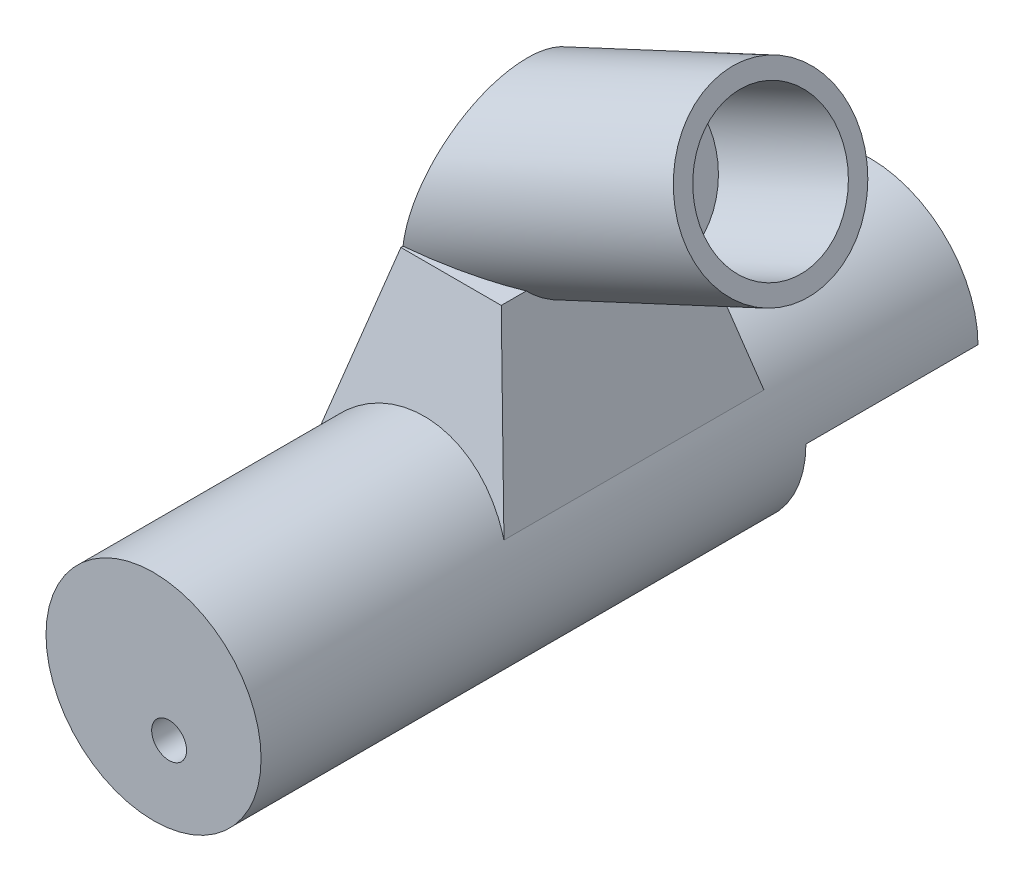
ISO-10303-21;
HEADER;
FILE_DESCRIPTION(('STEP AP214'),'2;1');
FILE_NAME('part.step','',(''),(''),'','','');
FILE_SCHEMA(('AUTOMOTIVE_DESIGN { 1 0 10303 214 1 1 1 1 }'));
ENDSEC;
DATA;
#1=APPLICATION_CONTEXT('core data for automotive mechanical design processes');
#2=APPLICATION_PROTOCOL_DEFINITION('international standard','automotive_design',2000,#1);
#3=PRODUCT_CONTEXT('',#1,'mechanical');
#4=PRODUCT('Part','Part','',(#3));
#5=PRODUCT_RELATED_PRODUCT_CATEGORY('part','',(#4));
#6=PRODUCT_DEFINITION_FORMATION('','',#4);
#7=PRODUCT_DEFINITION_CONTEXT('part definition',#1,'design');
#8=PRODUCT_DEFINITION('design','',#6,#7);
#9=PRODUCT_DEFINITION_SHAPE('','',#8);
#10=(LENGTH_UNIT() NAMED_UNIT(*) SI_UNIT(.MILLI.,.METRE.));
#11=(NAMED_UNIT(*) PLANE_ANGLE_UNIT() SI_UNIT($,.RADIAN.));
#12=(NAMED_UNIT(*) SI_UNIT($,.STERADIAN.) SOLID_ANGLE_UNIT());
#13=UNCERTAINTY_MEASURE_WITH_UNIT(LENGTH_MEASURE(1.E-05),#10,'distance_accuracy_value','');
#14=(GEOMETRIC_REPRESENTATION_CONTEXT(3) GLOBAL_UNCERTAINTY_ASSIGNED_CONTEXT((#13)) GLOBAL_UNIT_ASSIGNED_CONTEXT((#10,
#11,#12)) REPRESENTATION_CONTEXT('',''));
#15=CARTESIAN_POINT('',(0.,0.,0.));
#16=DIRECTION('',(0.,0.,1.));
#17=DIRECTION('',(1.,0.,0.));
#18=AXIS2_PLACEMENT_3D('',#15,#16,#17);
#19=CARTESIAN_POINT('',(0.,0.,-46.));
#20=DIRECTION('',(0.,0.,1.));
#21=DIRECTION('',(1.,0.,0.));
#22=AXIS2_PLACEMENT_3D('',#19,#20,#21);
#23=CYLINDRICAL_SURFACE('',#22,15.);
#24=CARTESIAN_POINT('',(0.,0.,54.));
#25=DIRECTION('',(0.,0.,1.));
#26=DIRECTION('',(1.,0.,0.));
#27=AXIS2_PLACEMENT_3D('',#24,#25,#26);
#28=CIRCLE('',#27,15.);
#29=CARTESIAN_POINT('',(15.,0.,54.));
#30=VERTEX_POINT('',#29);
#31=EDGE_CURVE('E318',#30,#30,#28,.T.);
#32=ORIENTED_EDGE('',*,*,#31,.F.);
#33=EDGE_LOOP('',(#32));
#34=FACE_BOUND('',#33,.T.);
#35=CARTESIAN_POINT('',(0.,0.,20.));
#36=DIRECTION('',(0.,-0.242535625036333,-0.970142500145332));
#37=DIRECTION('',(0.,-0.970142500145332,0.242535625036333));
#38=AXIS2_PLACEMENT_3D('',#35,#36,#37);
#39=ELLIPSE('',#38,15.4616460960662,15.);
#40=CARTESIAN_POINT('',(13.0082987551867,7.4688796680498,18.1327800829875));
#41=VERTEX_POINT('',#40);
#42=CARTESIAN_POINT('',(-13.0082987551867,7.4688796680498,18.1327800829876));
#43=VERTEX_POINT('',#42);
#44=EDGE_CURVE('E345',#41,#43,#39,.F.);
#45=ORIENTED_EDGE('',*,*,#44,.T.);
#46=DIRECTION('',(0.,0.,1.));
#47=VECTOR('',#46,1.);
#48=CARTESIAN_POINT('',(-13.0082987551867,7.46887966804975,-46.));
#49=LINE('',#48,#47);
#50=CARTESIAN_POINT('',(-13.0082987551867,7.46887966804979,-18.1327800829876));
#51=VERTEX_POINT('',#50);
#52=EDGE_CURVE('E57',#43,#51,#49,.F.);
#53=ORIENTED_EDGE('',*,*,#52,.T.);
#54=CARTESIAN_POINT('',(0.,0.,-20.));
#55=DIRECTION('',(0.,-0.242535625036333,0.970142500145332));
#56=DIRECTION('',(0.,0.970142500145332,0.242535625036333));
#57=AXIS2_PLACEMENT_3D('',#54,#55,#56);
#58=ELLIPSE('',#57,15.4616460960662,15.);
#59=CARTESIAN_POINT('',(13.0082987551867,7.4688796680498,-18.1327800829876));
#60=VERTEX_POINT('',#59);
#61=EDGE_CURVE('E357',#51,#60,#58,.F.);
#62=ORIENTED_EDGE('',*,*,#61,.T.);
#63=DIRECTION('',(0.,0.,1.));
#64=VECTOR('',#63,1.);
#65=CARTESIAN_POINT('',(13.0082987551867,7.4688796680498,-46.));
#66=LINE('',#65,#64);
#67=EDGE_CURVE('E351',#60,#41,#66,.T.);
#68=ORIENTED_EDGE('',*,*,#67,.T.);
#69=EDGE_LOOP('',(#45,#53,#62,#68));
#70=FACE_BOUND('',#69,.T.);
#71=CARTESIAN_POINT('',(0.,0.,-46.));
#72=DIRECTION('',(0.,0.,1.));
#73=DIRECTION('',(1.,0.,0.));
#74=AXIS2_PLACEMENT_3D('',#71,#72,#73);
#75=CIRCLE('',#74,15.);
#76=CARTESIAN_POINT('',(15.,0.,-46.));
#77=VERTEX_POINT('',#76);
#78=CARTESIAN_POINT('',(-15.,0.,-46.));
#79=VERTEX_POINT('',#78);
#80=EDGE_CURVE('E349',#77,#79,#75,.T.);
#81=ORIENTED_EDGE('',*,*,#80,.T.);
#82=DIRECTION('',(0.,0.,-1.));
#83=VECTOR('',#82,1.);
#84=CARTESIAN_POINT('',(-15.,0.,-22.));
#85=LINE('',#84,#83);
#86=CARTESIAN_POINT('',(-15.,0.,-22.));
#87=VERTEX_POINT('',#86);
#88=EDGE_CURVE('E150',#87,#79,#85,.T.);
#89=ORIENTED_EDGE('',*,*,#88,.F.);
#90=CARTESIAN_POINT('',(0.,0.,-22.));
#91=DIRECTION('',(0.,0.,-1.));
#92=DIRECTION('',(-1.,0.,0.));
#93=AXIS2_PLACEMENT_3D('',#90,#91,#92);
#94=CIRCLE('',#93,15.);
#95=CARTESIAN_POINT('',(15.,0.,-22.));
#96=VERTEX_POINT('',#95);
#97=EDGE_CURVE('E143',#96,#87,#94,.T.);
#98=ORIENTED_EDGE('',*,*,#97,.F.);
#99=DIRECTION('',(0.,0.,-1.));
#100=VECTOR('',#99,1.);
#101=CARTESIAN_POINT('',(15.,0.,-22.));
#102=LINE('',#101,#100);
#103=EDGE_CURVE('E142',#96,#77,#102,.T.);
#104=ORIENTED_EDGE('',*,*,#103,.T.);
#105=EDGE_LOOP('',(#81,#89,#98,#104));
#106=FACE_BOUND('',#105,.T.);
#107=ADVANCED_FACE('F48',(#34,#70,#106),#23,.T.);
#108=CARTESIAN_POINT('',(0.,0.,-46.));
#109=DIRECTION('',(0.,0.,1.));
#110=DIRECTION('',(1.,0.,0.));
#111=AXIS2_PLACEMENT_3D('',#108,#109,#110);
#112=PLANE('',#111);
#113=DIRECTION('',(-1.,0.,0.));
#114=VECTOR('',#113,1.);
#115=CARTESIAN_POINT('',(0.,0.,-46.));
#116=LINE('',#115,#114);
#117=CARTESIAN_POINT('',(-12.5,0.,-46.));
#118=VERTEX_POINT('',#117);
#119=EDGE_CURVE('E135',#118,#79,#116,.T.);
#120=ORIENTED_EDGE('',*,*,#119,.T.);
#121=ORIENTED_EDGE('',*,*,#80,.F.);
#122=DIRECTION('',(1.,0.,0.));
#123=VECTOR('',#122,1.);
#124=CARTESIAN_POINT('',(0.,0.,-46.));
#125=LINE('',#124,#123);
#126=CARTESIAN_POINT('',(12.5,0.,-46.));
#127=VERTEX_POINT('',#126);
#128=EDGE_CURVE('E370',#127,#77,#125,.T.);
#129=ORIENTED_EDGE('',*,*,#128,.F.);
#130=CARTESIAN_POINT('',(0.,0.,-46.));
#131=DIRECTION('',(0.,0.,-1.));
#132=DIRECTION('',(-1.,0.,0.));
#133=AXIS2_PLACEMENT_3D('',#130,#131,#132);
#134=CIRCLE('',#133,12.5);
#135=EDGE_CURVE('E148',#118,#127,#134,.T.);
#136=ORIENTED_EDGE('',*,*,#135,.F.);
#137=EDGE_LOOP('',(#120,#121,#129,#136));
#138=FACE_BOUND('',#137,.T.);
#139=ADVANCED_FACE('F332',(#138),#112,.F.);
#140=CARTESIAN_POINT('',(0.,0.,49.0000000000001));
#141=DIRECTION('',(0.,0.,-1.));
#142=DIRECTION('',(-1.,0.,0.));
#143=AXIS2_PLACEMENT_3D('',#140,#141,#142);
#144=CYLINDRICAL_SURFACE('',#143,12.5);
#145=CARTESIAN_POINT('',(0.,0.,49.0000000000001));
#146=DIRECTION('',(0.,0.,-1.));
#147=DIRECTION('',(-1.,0.,0.));
#148=AXIS2_PLACEMENT_3D('',#145,#146,#147);
#149=CIRCLE('',#148,12.5);
#150=CARTESIAN_POINT('',(-12.5,0.,49.0000000000001));
#151=VERTEX_POINT('',#150);
#152=EDGE_CURVE('E155',#151,#151,#149,.T.);
#153=ORIENTED_EDGE('',*,*,#152,.F.);
#154=EDGE_LOOP('',(#153));
#155=FACE_BOUND('',#154,.T.);
#156=DIRECTION('',(0.,0.,-1.));
#157=VECTOR('',#156,1.);
#158=CARTESIAN_POINT('',(-12.5,0.,-22.));
#159=LINE('',#158,#157);
#160=CARTESIAN_POINT('',(-12.5,0.,-22.));
#161=VERTEX_POINT('',#160);
#162=EDGE_CURVE('E65',#161,#118,#159,.T.);
#163=ORIENTED_EDGE('',*,*,#162,.T.);
#164=ORIENTED_EDGE('',*,*,#135,.T.);
#165=DIRECTION('',(0.,0.,-1.));
#166=VECTOR('',#165,1.);
#167=CARTESIAN_POINT('',(12.5,0.,-22.));
#168=LINE('',#167,#166);
#169=CARTESIAN_POINT('',(12.5,0.,-22.));
#170=VERTEX_POINT('',#169);
#171=EDGE_CURVE('E139',#170,#127,#168,.T.);
#172=ORIENTED_EDGE('',*,*,#171,.F.);
#173=CARTESIAN_POINT('',(0.,0.,-22.));
#174=DIRECTION('',(0.,0.,-1.));
#175=DIRECTION('',(-1.,0.,0.));
#176=AXIS2_PLACEMENT_3D('',#173,#174,#175);
#177=CIRCLE('',#176,12.5);
#178=EDGE_CURVE('E126',#170,#161,#177,.T.);
#179=ORIENTED_EDGE('',*,*,#178,.T.);
#180=EDGE_LOOP('',(#163,#164,#172,#179));
#181=FACE_BOUND('',#180,.T.);
#182=ADVANCED_FACE('F146',(#155,#181),#144,.F.);
#183=CARTESIAN_POINT('',(0.,30.,0.));
#184=DIRECTION('',(0.,1.,0.));
#185=DIRECTION('',(0.,0.,1.));
#186=AXIS2_PLACEMENT_3D('',#183,#184,#185);
#187=PLANE('',#186);
#188=CARTESIAN_POINT('',(-13.4936044314027,30.,0.));
#189=DIRECTION('',(0.,1.,0.));
#190=DIRECTION('',(1.,0.,0.));
#191=AXIS2_PLACEMENT_3D('',#188,#189,#190);
#192=ELLIPSE('',#191,29.5775197894062,12.5);
#193=CARTESIAN_POINT('',(7.,30.,-9.01318883608321));
#194=VERTEX_POINT('',#193);
#195=CARTESIAN_POINT('',(-7.00000000000001,30.,-12.1950289337621));
#196=VERTEX_POINT('',#195);
#197=EDGE_CURVE('E174',#194,#196,#192,.T.);
#198=ORIENTED_EDGE('',*,*,#197,.F.);
#199=DIRECTION('',(0.,0.,-1.));
#200=VECTOR('',#199,1.);
#201=CARTESIAN_POINT('',(7.,30.,-12.5));
#202=LINE('',#201,#200);
#203=CARTESIAN_POINT('',(7.,30.,-12.5));
#204=VERTEX_POINT('',#203);
#205=EDGE_CURVE('E189',#194,#204,#202,.T.);
#206=ORIENTED_EDGE('',*,*,#205,.T.);
#207=DIRECTION('',(-1.,0.,0.));
#208=VECTOR('',#207,1.);
#209=CARTESIAN_POINT('',(-7.,30.,-12.5));
#210=LINE('',#209,#208);
#211=CARTESIAN_POINT('',(-7.,30.,-12.5));
#212=VERTEX_POINT('',#211);
#213=EDGE_CURVE('E207',#204,#212,#210,.T.);
#214=ORIENTED_EDGE('',*,*,#213,.T.);
#215=DIRECTION('',(0.,0.,1.));
#216=VECTOR('',#215,1.);
#217=CARTESIAN_POINT('',(-7.,30.,-12.5));
#218=LINE('',#217,#216);
#219=EDGE_CURVE('E317',#212,#196,#218,.T.);
#220=ORIENTED_EDGE('',*,*,#219,.T.);
#221=EDGE_LOOP('',(#198,#206,#214,#220));
#222=FACE_BOUND('',#221,.T.);
#223=ADVANCED_FACE('F294',(#222),#187,.T.);
#224=CARTESIAN_POINT('',(0.,0.,54.));
#225=DIRECTION('',(0.,0.,1.));
#226=DIRECTION('',(1.,0.,0.));
#227=AXIS2_PLACEMENT_3D('',#224,#225,#226);
#228=PLANE('',#227);
#229=CARTESIAN_POINT('',(2.172182,-4.20172885356445,54.));
#230=DIRECTION('',(0.,0.,1.));
#231=DIRECTION('',(1.,0.,0.));
#232=AXIS2_PLACEMENT_3D('',#229,#230,#231);
#233=CIRCLE('',#232,2.435);
#234=CARTESIAN_POINT('',(4.607182,-4.20172885356445,54.));
#235=VERTEX_POINT('',#234);
#236=EDGE_CURVE('E368',#235,#235,#233,.T.);
#237=ORIENTED_EDGE('',*,*,#236,.F.);
#238=EDGE_LOOP('',(#237));
#239=FACE_BOUND('',#238,.T.);
#240=ORIENTED_EDGE('',*,*,#31,.T.);
#241=EDGE_LOOP('',(#240));
#242=FACE_BOUND('',#241,.T.);
#243=ADVANCED_FACE('F293',(#239,#242),#228,.T.);
#244=CARTESIAN_POINT('',(-7.,30.,12.1950289337621));
#245=VERTEX_POINT('',#244);
#246=CARTESIAN_POINT('',(7.,30.,9.01318883608323));
#247=VERTEX_POINT('',#246);
#248=EDGE_CURVE('E73',#245,#247,#192,.T.);
#249=ORIENTED_EDGE('',*,*,#248,.F.);
#250=CARTESIAN_POINT('',(-7.,30.,12.5));
#251=VERTEX_POINT('',#250);
#252=EDGE_CURVE('E51',#245,#251,#218,.T.);
#253=ORIENTED_EDGE('',*,*,#252,.T.);
#254=DIRECTION('',(1.,0.,0.));
#255=VECTOR('',#254,1.);
#256=CARTESIAN_POINT('',(-7.,30.,12.5));
#257=LINE('',#256,#255);
#258=CARTESIAN_POINT('',(7.,30.,12.5));
#259=VERTEX_POINT('',#258);
#260=EDGE_CURVE('E306',#251,#259,#257,.T.);
#261=ORIENTED_EDGE('',*,*,#260,.T.);
#262=EDGE_CURVE('E249',#259,#247,#202,.T.);
#263=ORIENTED_EDGE('',*,*,#262,.T.);
#264=EDGE_LOOP('',(#249,#253,#261,#263));
#265=FACE_BOUND('',#264,.T.);
#266=ADVANCED_FACE('F284',(#265),#187,.T.);
#267=CARTESIAN_POINT('',(-14.0041493775934,3.7344398340249,0.));
#268=DIRECTION('',(0.966234939601246,-0.257662650560333,0.));
#269=DIRECTION('',(0.257662650560333,0.966234939601246,0.));
#270=AXIS2_PLACEMENT_3D('',#267,#268,#269);
#271=PLANE('',#270);
#272=ORIENTED_EDGE('',*,*,#252,.F.);
#273=CARTESIAN_POINT('',(-6.07786200406005,33.4580174847748,0.));
#274=DIRECTION('',(0.966234939601246,-0.257662650560333,0.));
#275=DIRECTION('',(0.257662650560333,0.966234939601246,0.));
#276=AXIS2_PLACEMENT_3D('',#273,#274,#275);
#277=ELLIPSE('',#276,16.3012298606754,12.5);
#278=EDGE_CURVE('E168',#245,#196,#277,.F.);
#279=ORIENTED_EDGE('',*,*,#278,.T.);
#280=ORIENTED_EDGE('',*,*,#219,.F.);
#281=DIRECTION('',(0.250459024806617,0.939221343024814,0.234805335756204));
#282=VECTOR('',#281,1.);
#283=CARTESIAN_POINT('',(-15.,0.,-20.));
#284=LINE('',#283,#282);
#285=EDGE_CURVE('E197',#51,#212,#284,.T.);
#286=ORIENTED_EDGE('',*,*,#285,.F.);
#287=ORIENTED_EDGE('',*,*,#52,.F.);
#288=DIRECTION('',(0.250459024806617,0.939221343024814,-0.234805335756204));
#289=VECTOR('',#288,1.);
#290=CARTESIAN_POINT('',(-15.,0.,20.));
#291=LINE('',#290,#289);
#292=EDGE_CURVE('E179',#43,#251,#291,.T.);
#293=ORIENTED_EDGE('',*,*,#292,.T.);
#294=EDGE_LOOP('',(#272,#279,#280,#286,#287,#293));
#295=FACE_BOUND('',#294,.T.);
#296=ADVANCED_FACE('F225',(#295),#271,.F.);
#297=CARTESIAN_POINT('',(0.,4.70588235294118,-18.8235294117647));
#298=DIRECTION('',(0.,-0.242535625036333,0.970142500145332));
#299=DIRECTION('',(0.,-0.970142500145332,-0.242535625036333));
#300=AXIS2_PLACEMENT_3D('',#297,#298,#299);
#301=PLANE('',#300);
#302=ORIENTED_EDGE('',*,*,#61,.F.);
#303=ORIENTED_EDGE('',*,*,#285,.T.);
#304=ORIENTED_EDGE('',*,*,#213,.F.);
#305=DIRECTION('',(-0.250459024806617,0.939221343024814,0.234805335756204));
#306=VECTOR('',#305,1.);
#307=CARTESIAN_POINT('',(15.,0.,-20.));
#308=LINE('',#307,#306);
#309=EDGE_CURVE('E185',#60,#204,#308,.T.);
#310=ORIENTED_EDGE('',*,*,#309,.F.);
#311=EDGE_LOOP('',(#302,#303,#304,#310));
#312=FACE_BOUND('',#311,.T.);
#313=ADVANCED_FACE('F214',(#312),#301,.F.);
#314=CARTESIAN_POINT('',(0.,4.70588235294118,18.8235294117647));
#315=DIRECTION('',(0.,-0.242535625036333,-0.970142500145332));
#316=DIRECTION('',(0.,0.970142500145332,-0.242535625036333));
#317=AXIS2_PLACEMENT_3D('',#314,#315,#316);
#318=PLANE('',#317);
#319=ORIENTED_EDGE('',*,*,#44,.F.);
#320=DIRECTION('',(-0.250459024806617,0.939221343024814,-0.234805335756204));
#321=VECTOR('',#320,1.);
#322=CARTESIAN_POINT('',(15.,0.,20.));
#323=LINE('',#322,#321);
#324=EDGE_CURVE('E190',#41,#259,#323,.T.);
#325=ORIENTED_EDGE('',*,*,#324,.T.);
#326=ORIENTED_EDGE('',*,*,#260,.F.);
#327=ORIENTED_EDGE('',*,*,#292,.F.);
#328=EDGE_LOOP('',(#319,#325,#326,#327));
#329=FACE_BOUND('',#328,.T.);
#330=ADVANCED_FACE('F224',(#329),#318,.F.);
#331=CARTESIAN_POINT('',(14.0041493775934,3.7344398340249,0.));
#332=DIRECTION('',(-0.966234939601246,-0.257662650560332,0.));
#333=DIRECTION('',(0.257662650560332,-0.966234939601246,0.));
#334=AXIS2_PLACEMENT_3D('',#331,#332,#333);
#335=PLANE('',#334);
#336=ORIENTED_EDGE('',*,*,#205,.F.);
#337=CARTESIAN_POINT('',(4.73348496733181,38.4994313725057,0.));
#338=DIRECTION('',(-0.966234939601246,-0.257662650560332,0.));
#339=DIRECTION('',(-0.257662650560332,0.966234939601246,0.));
#340=AXIS2_PLACEMENT_3D('',#337,#338,#339);
#341=ELLIPSE('',#340,12.6955212939983,12.5);
#342=EDGE_CURVE('E12',#194,#247,#341,.T.);
#343=ORIENTED_EDGE('',*,*,#342,.T.);
#344=ORIENTED_EDGE('',*,*,#262,.F.);
#345=ORIENTED_EDGE('',*,*,#324,.F.);
#346=ORIENTED_EDGE('',*,*,#67,.F.);
#347=ORIENTED_EDGE('',*,*,#309,.T.);
#348=EDGE_LOOP('',(#336,#343,#344,#345,#346,#347));
#349=FACE_BOUND('',#348,.T.);
#350=ADVANCED_FACE('F231',(#349),#335,.F.);
#351=CARTESIAN_POINT('',(-42.9927659385992,16.2443150800431,0.));
#352=DIRECTION('',(0.906307787036649,0.4226182617407,0.));
#353=DIRECTION('',(-0.422618261740701,0.90630778703665,0.));
#354=AXIS2_PLACEMENT_3D('',#351,#352,#353);
#355=CYLINDRICAL_SURFACE('',#354,12.5);
#356=ORIENTED_EDGE('',*,*,#342,.F.);
#357=ORIENTED_EDGE('',*,*,#197,.T.);
#358=ORIENTED_EDGE('',*,*,#278,.F.);
#359=ORIENTED_EDGE('',*,*,#248,.T.);
#360=EDGE_LOOP('',(#356,#357,#358,#359));
#361=FACE_BOUND('',#360,.T.);
#362=CARTESIAN_POINT('',(32.065513698419,51.2445656827242,0.));
#363=DIRECTION('',(0.906307787036649,0.422618261740701,0.));
#364=DIRECTION('',(-0.422618261740701,0.906307787036649,0.));
#365=AXIS2_PLACEMENT_3D('',#362,#363,#364);
#366=CIRCLE('',#365,12.5);
#367=CARTESIAN_POINT('',(26.7827854266603,62.5734130206823,0.));
#368=VERTEX_POINT('',#367);
#369=EDGE_CURVE('E163',#368,#368,#366,.T.);
#370=ORIENTED_EDGE('',*,*,#369,.F.);
#371=EDGE_LOOP('',(#370));
#372=FACE_BOUND('',#371,.T.);
#373=ADVANCED_FACE('F324',(#361,#372),#355,.T.);
#374=CARTESIAN_POINT('',(45.9662216916466,21.4344011912653,0.));
#375=DIRECTION('',(0.906307787036649,0.422618261740701,0.));
#376=DIRECTION('',(-0.422618261740701,0.906307787036649,0.));
#377=AXIS2_PLACEMENT_3D('',#374,#375,#376);
#378=PLANE('',#377);
#379=CARTESIAN_POINT('',(32.065513698419,51.2445656827242,0.));
#380=DIRECTION('',(0.906307787036649,0.422618261740701,0.));
#381=DIRECTION('',(-0.422618261740701,0.906307787036649,0.));
#382=AXIS2_PLACEMENT_3D('',#379,#380,#381);
#383=CIRCLE('',#382,10.);
#384=CARTESIAN_POINT('',(27.839331081012,60.3076435530907,0.));
#385=VERTEX_POINT('',#384);
#386=EDGE_CURVE('E158',#385,#385,#383,.T.);
#387=ORIENTED_EDGE('',*,*,#386,.F.);
#388=EDGE_LOOP('',(#387));
#389=FACE_BOUND('',#388,.T.);
#390=ORIENTED_EDGE('',*,*,#369,.T.);
#391=EDGE_LOOP('',(#390));
#392=FACE_BOUND('',#391,.T.);
#393=ADVANCED_FACE('F330',(#389,#392),#378,.T.);
#394=CARTESIAN_POINT('',(13.9393579576861,42.7922004479102,0.));
#395=DIRECTION('',(0.906307787036649,0.422618261740701,0.));
#396=DIRECTION('',(-0.422618261740701,0.906307787036649,0.));
#397=AXIS2_PLACEMENT_3D('',#394,#395,#396);
#398=CYLINDRICAL_SURFACE('',#397,10.);
#399=CARTESIAN_POINT('',(13.9393579576861,42.7922004479102,0.));
#400=DIRECTION('',(0.906307787036649,0.422618261740701,0.));
#401=DIRECTION('',(-0.422618261740701,0.906307787036649,0.));
#402=AXIS2_PLACEMENT_3D('',#399,#400,#401);
#403=CIRCLE('',#402,10.);
#404=CARTESIAN_POINT('',(9.71317534027905,51.8552783182767,0.));
#405=VERTEX_POINT('',#404);
#406=EDGE_CURVE('E160',#405,#405,#403,.T.);
#407=ORIENTED_EDGE('',*,*,#406,.F.);
#408=EDGE_LOOP('',(#407));
#409=FACE_BOUND('',#408,.T.);
#410=ORIENTED_EDGE('',*,*,#386,.T.);
#411=EDGE_LOOP('',(#410));
#412=FACE_BOUND('',#411,.T.);
#413=ADVANCED_FACE('F399',(#409,#412),#398,.F.);
#414=CARTESIAN_POINT('',(27.8400659509136,12.9820359564513,0.));
#415=DIRECTION('',(0.906307787036649,0.422618261740701,0.));
#416=DIRECTION('',(-0.422618261740701,0.906307787036649,0.));
#417=AXIS2_PLACEMENT_3D('',#414,#415,#416);
#418=PLANE('',#417);
#419=ORIENTED_EDGE('',*,*,#406,.T.);
#420=EDGE_LOOP('',(#419));
#421=FACE_BOUND('',#420,.T.);
#422=ADVANCED_FACE('F388',(#421),#418,.T.);
#423=CARTESIAN_POINT('',(0.,0.,49.0000000000001));
#424=DIRECTION('',(0.,0.,-1.));
#425=DIRECTION('',(-1.,0.,0.));
#426=AXIS2_PLACEMENT_3D('',#423,#424,#425);
#427=PLANE('',#426);
#428=CARTESIAN_POINT('',(2.172182,-4.20172885356445,49.));
#429=DIRECTION('',(0.,0.,-1.));
#430=DIRECTION('',(-1.,0.,0.));
#431=AXIS2_PLACEMENT_3D('',#428,#429,#430);
#432=CIRCLE('',#431,2.435);
#433=CARTESIAN_POINT('',(-0.262818,-4.20172885356445,49.));
#434=VERTEX_POINT('',#433);
#435=EDGE_CURVE('E371',#434,#434,#432,.F.);
#436=ORIENTED_EDGE('',*,*,#435,.T.);
#437=EDGE_LOOP('',(#436));
#438=FACE_BOUND('',#437,.T.);
#439=ORIENTED_EDGE('',*,*,#152,.T.);
#440=EDGE_LOOP('',(#439));
#441=FACE_BOUND('',#440,.T.);
#442=ADVANCED_FACE('F381',(#438,#441),#427,.T.);
#443=CARTESIAN_POINT('',(0.,0.,-22.));
#444=DIRECTION('',(0.,-1.,0.));
#445=DIRECTION('',(0.,0.,-1.));
#446=AXIS2_PLACEMENT_3D('',#443,#444,#445);
#447=PLANE('',#446);
#448=ORIENTED_EDGE('',*,*,#119,.F.);
#449=ORIENTED_EDGE('',*,*,#162,.F.);
#450=DIRECTION('',(-1.,0.,0.));
#451=VECTOR('',#450,1.);
#452=CARTESIAN_POINT('',(0.,0.,-22.));
#453=LINE('',#452,#451);
#454=EDGE_CURVE('E132',#161,#87,#453,.T.);
#455=ORIENTED_EDGE('',*,*,#454,.T.);
#456=ORIENTED_EDGE('',*,*,#88,.T.);
#457=EDGE_LOOP('',(#448,#449,#455,#456));
#458=FACE_BOUND('',#457,.T.);
#459=ADVANCED_FACE('F379',(#458),#447,.T.);
#460=CARTESIAN_POINT('',(0.,0.,-22.));
#461=DIRECTION('',(0.,1.,0.));
#462=DIRECTION('',(0.,0.,1.));
#463=AXIS2_PLACEMENT_3D('',#460,#461,#462);
#464=PLANE('',#463);
#465=ORIENTED_EDGE('',*,*,#128,.T.);
#466=ORIENTED_EDGE('',*,*,#103,.F.);
#467=DIRECTION('',(1.,0.,0.));
#468=VECTOR('',#467,1.);
#469=CARTESIAN_POINT('',(0.,0.,-22.));
#470=LINE('',#469,#468);
#471=EDGE_CURVE('E130',#170,#96,#470,.T.);
#472=ORIENTED_EDGE('',*,*,#471,.F.);
#473=ORIENTED_EDGE('',*,*,#171,.T.);
#474=EDGE_LOOP('',(#465,#466,#472,#473));
#475=FACE_BOUND('',#474,.T.);
#476=ADVANCED_FACE('F138',(#475),#464,.F.);
#477=CARTESIAN_POINT('',(0.,0.,-22.));
#478=DIRECTION('',(0.,0.,-1.));
#479=DIRECTION('',(-1.,0.,0.));
#480=AXIS2_PLACEMENT_3D('',#477,#478,#479);
#481=PLANE('',#480);
#482=ORIENTED_EDGE('',*,*,#178,.F.);
#483=ORIENTED_EDGE('',*,*,#471,.T.);
#484=ORIENTED_EDGE('',*,*,#97,.T.);
#485=ORIENTED_EDGE('',*,*,#454,.F.);
#486=EDGE_LOOP('',(#482,#483,#484,#485));
#487=FACE_BOUND('',#486,.T.);
#488=ADVANCED_FACE('F128',(#487),#481,.T.);
#489=CARTESIAN_POINT('',(2.172182,-4.20172885356445,-46.001));
#490=DIRECTION('',(0.,0.,1.));
#491=DIRECTION('',(1.,0.,0.));
#492=AXIS2_PLACEMENT_3D('',#489,#490,#491);
#493=CYLINDRICAL_SURFACE('',#492,2.435);
#494=ORIENTED_EDGE('',*,*,#435,.F.);
#495=EDGE_LOOP('',(#494));
#496=FACE_BOUND('',#495,.T.);
#497=ORIENTED_EDGE('',*,*,#236,.T.);
#498=EDGE_LOOP('',(#497));
#499=FACE_BOUND('',#498,.T.);
#500=ADVANCED_FACE('F435',(#496,#499),#493,.F.);
#501=CLOSED_SHELL('',(#107,#139,#182,#223,#243,#266,#296,#313,#330,#350,#373,#393,#413,#422,
#442,#459,#476,#488,#500));
#502=MANIFOLD_SOLID_BREP('B2',#501);
#503=ADVANCED_BREP_SHAPE_REPRESENTATION('',(#18,#502),#14);
#504=SHAPE_DEFINITION_REPRESENTATION(#9,#503);
ENDSEC;
END-ISO-10303-21;
